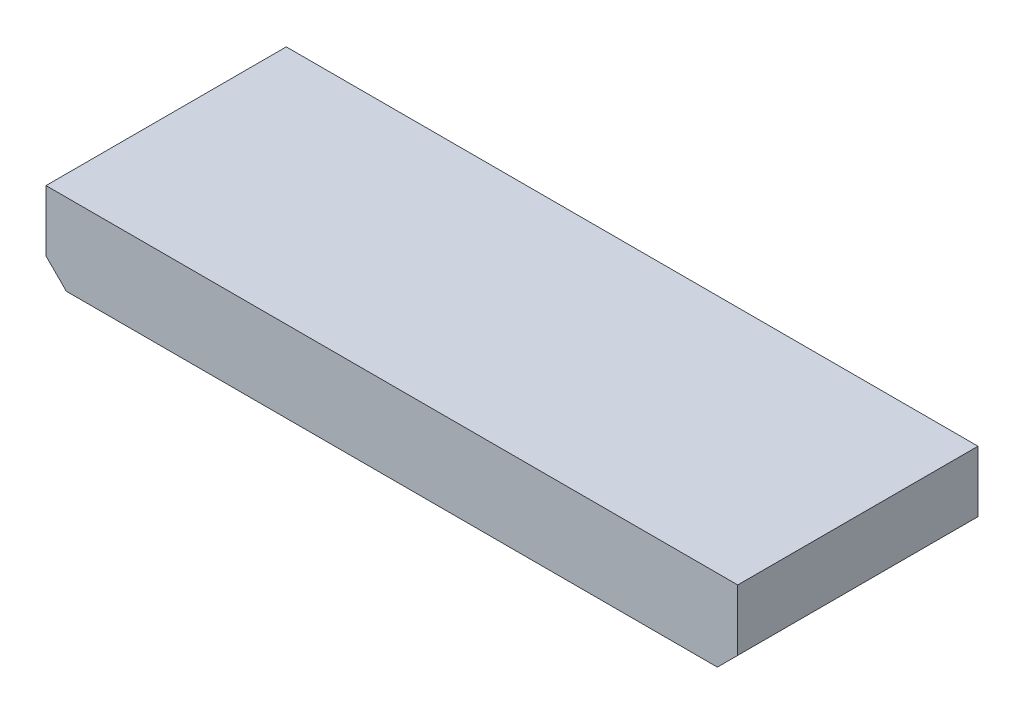
ISO-10303-21;
HEADER;
FILE_DESCRIPTION(('STEP AP214'),'2;1');
FILE_NAME('part.step','',(''),(''),'','','');
FILE_SCHEMA(('AUTOMOTIVE_DESIGN { 1 0 10303 214 1 1 1 1 }'));
ENDSEC;
DATA;
#1=APPLICATION_CONTEXT('core data for automotive mechanical design processes');
#2=APPLICATION_PROTOCOL_DEFINITION('international standard','automotive_design',2000,#1);
#3=PRODUCT_CONTEXT('',#1,'mechanical');
#4=PRODUCT('Part','Part','',(#3));
#5=PRODUCT_RELATED_PRODUCT_CATEGORY('part','',(#4));
#6=PRODUCT_DEFINITION_FORMATION('','',#4);
#7=PRODUCT_DEFINITION_CONTEXT('part definition',#1,'design');
#8=PRODUCT_DEFINITION('design','',#6,#7);
#9=PRODUCT_DEFINITION_SHAPE('','',#8);
#10=(LENGTH_UNIT() NAMED_UNIT(*) SI_UNIT(.MILLI.,.METRE.));
#11=(NAMED_UNIT(*) PLANE_ANGLE_UNIT() SI_UNIT($,.RADIAN.));
#12=(NAMED_UNIT(*) SI_UNIT($,.STERADIAN.) SOLID_ANGLE_UNIT());
#13=UNCERTAINTY_MEASURE_WITH_UNIT(LENGTH_MEASURE(1.E-05),#10,'distance_accuracy_value','');
#14=(GEOMETRIC_REPRESENTATION_CONTEXT(3) GLOBAL_UNCERTAINTY_ASSIGNED_CONTEXT((#13)) GLOBAL_UNIT_ASSIGNED_CONTEXT((#10,
#11,#12)) REPRESENTATION_CONTEXT('',''));
#15=CARTESIAN_POINT('',(0.,0.,0.));
#16=DIRECTION('',(0.,0.,1.));
#17=DIRECTION('',(1.,0.,0.));
#18=AXIS2_PLACEMENT_3D('',#15,#16,#17);
#19=CARTESIAN_POINT('',(33.02,0.,-2.));
#20=DIRECTION('',(0.,0.,1.));
#21=DIRECTION('',(1.,0.,0.));
#22=AXIS2_PLACEMENT_3D('',#19,#20,#21);
#23=CYLINDRICAL_SURFACE('',#22,0.25);
#24=CARTESIAN_POINT('',(33.02,0.,-2.));
#25=DIRECTION('',(0.,0.,1.));
#26=DIRECTION('',(1.,0.,0.));
#27=AXIS2_PLACEMENT_3D('',#24,#25,#26);
#28=CIRCLE('',#27,0.25);
#29=CARTESIAN_POINT('',(33.27,0.,-2.));
#30=VERTEX_POINT('',#29);
#31=EDGE_CURVE('E11',#30,#30,#28,.T.);
#32=ORIENTED_EDGE('',*,*,#31,.T.);
#33=EDGE_LOOP('',(#32));
#34=FACE_BOUND('',#33,.T.);
#35=CARTESIAN_POINT('',(33.02,0.,0.));
#36=DIRECTION('',(0.,0.,1.));
#37=DIRECTION('',(1.,0.,0.));
#38=AXIS2_PLACEMENT_3D('',#35,#36,#37);
#39=CIRCLE('',#38,0.25);
#40=CARTESIAN_POINT('',(33.27,0.,0.));
#41=VERTEX_POINT('',#40);
#42=EDGE_CURVE('E43',#41,#41,#39,.T.);
#43=ORIENTED_EDGE('',*,*,#42,.F.);
#44=EDGE_LOOP('',(#43));
#45=FACE_BOUND('',#44,.T.);
#46=ADVANCED_FACE('F40',(#34,#45),#23,.T.);
#47=CARTESIAN_POINT('',(33.02,0.,-2.));
#48=DIRECTION('',(0.,0.,1.));
#49=DIRECTION('',(1.,0.,0.));
#50=AXIS2_PLACEMENT_3D('',#47,#48,#49);
#51=PLANE('',#50);
#52=ORIENTED_EDGE('',*,*,#31,.F.);
#53=EDGE_LOOP('',(#52));
#54=FACE_BOUND('',#53,.T.);
#55=ADVANCED_FACE('F55',(#54),#51,.F.);
#56=CARTESIAN_POINT('',(33.02,0.,0.));
#57=DIRECTION('',(0.,0.,1.));
#58=DIRECTION('',(1.,0.,0.));
#59=AXIS2_PLACEMENT_3D('',#56,#57,#58);
#60=PLANE('',#59);
#61=ORIENTED_EDGE('',*,*,#42,.T.);
#62=EDGE_LOOP('',(#61));
#63=FACE_BOUND('',#62,.T.);
#64=ADVANCED_FACE('F52',(#63),#60,.T.);
#65=CLOSED_SHELL('',(#46,#55,#64));
#66=MANIFOLD_SOLID_BREP('B2',#65);
#67=CARTESIAN_POINT('',(30.48,0.,-2.));
#68=DIRECTION('',(0.,0.,1.));
#69=DIRECTION('',(1.,0.,0.));
#70=AXIS2_PLACEMENT_3D('',#67,#68,#69);
#71=CYLINDRICAL_SURFACE('',#70,0.25);
#72=CARTESIAN_POINT('',(30.48,0.,-2.));
#73=DIRECTION('',(0.,0.,1.));
#74=DIRECTION('',(1.,0.,0.));
#75=AXIS2_PLACEMENT_3D('',#72,#73,#74);
#76=CIRCLE('',#75,0.25);
#77=CARTESIAN_POINT('',(30.73,0.,-2.));
#78=VERTEX_POINT('',#77);
#79=EDGE_CURVE('E39',#78,#78,#76,.T.);
#80=ORIENTED_EDGE('',*,*,#79,.T.);
#81=EDGE_LOOP('',(#80));
#82=FACE_BOUND('',#81,.T.);
#83=CARTESIAN_POINT('',(30.48,0.,0.));
#84=DIRECTION('',(0.,0.,1.));
#85=DIRECTION('',(1.,0.,0.));
#86=AXIS2_PLACEMENT_3D('',#83,#84,#85);
#87=CIRCLE('',#86,0.25);
#88=CARTESIAN_POINT('',(30.73,0.,0.));
#89=VERTEX_POINT('',#88);
#90=EDGE_CURVE('E92',#89,#89,#87,.T.);
#91=ORIENTED_EDGE('',*,*,#90,.F.);
#92=EDGE_LOOP('',(#91));
#93=FACE_BOUND('',#92,.T.);
#94=ADVANCED_FACE('F89',(#82,#93),#71,.T.);
#95=CARTESIAN_POINT('',(30.48,0.,-2.));
#96=DIRECTION('',(0.,0.,1.));
#97=DIRECTION('',(1.,0.,0.));
#98=AXIS2_PLACEMENT_3D('',#95,#96,#97);
#99=PLANE('',#98);
#100=ORIENTED_EDGE('',*,*,#79,.F.);
#101=EDGE_LOOP('',(#100));
#102=FACE_BOUND('',#101,.T.);
#103=ADVANCED_FACE('F104',(#102),#99,.F.);
#104=CARTESIAN_POINT('',(30.48,0.,0.));
#105=DIRECTION('',(0.,0.,1.));
#106=DIRECTION('',(1.,0.,0.));
#107=AXIS2_PLACEMENT_3D('',#104,#105,#106);
#108=PLANE('',#107);
#109=ORIENTED_EDGE('',*,*,#90,.T.);
#110=EDGE_LOOP('',(#109));
#111=FACE_BOUND('',#110,.T.);
#112=ADVANCED_FACE('F101',(#111),#108,.T.);
#113=CLOSED_SHELL('',(#94,#103,#112));
#114=MANIFOLD_SOLID_BREP('B6',#113);
#115=CARTESIAN_POINT('',(27.94,0.,-2.));
#116=DIRECTION('',(0.,0.,1.));
#117=DIRECTION('',(1.,0.,0.));
#118=AXIS2_PLACEMENT_3D('',#115,#116,#117);
#119=CYLINDRICAL_SURFACE('',#118,0.25);
#120=CARTESIAN_POINT('',(27.94,0.,-2.));
#121=DIRECTION('',(0.,0.,1.));
#122=DIRECTION('',(1.,0.,0.));
#123=AXIS2_PLACEMENT_3D('',#120,#121,#122);
#124=CIRCLE('',#123,0.25);
#125=CARTESIAN_POINT('',(28.19,0.,-2.));
#126=VERTEX_POINT('',#125);
#127=EDGE_CURVE('E88',#126,#126,#124,.T.);
#128=ORIENTED_EDGE('',*,*,#127,.T.);
#129=EDGE_LOOP('',(#128));
#130=FACE_BOUND('',#129,.T.);
#131=CARTESIAN_POINT('',(27.94,0.,0.));
#132=DIRECTION('',(0.,0.,1.));
#133=DIRECTION('',(1.,0.,0.));
#134=AXIS2_PLACEMENT_3D('',#131,#132,#133);
#135=CIRCLE('',#134,0.25);
#136=CARTESIAN_POINT('',(28.19,0.,0.));
#137=VERTEX_POINT('',#136);
#138=EDGE_CURVE('E141',#137,#137,#135,.T.);
#139=ORIENTED_EDGE('',*,*,#138,.F.);
#140=EDGE_LOOP('',(#139));
#141=FACE_BOUND('',#140,.T.);
#142=ADVANCED_FACE('F138',(#130,#141),#119,.T.);
#143=CARTESIAN_POINT('',(27.94,0.,-2.));
#144=DIRECTION('',(0.,0.,1.));
#145=DIRECTION('',(1.,0.,0.));
#146=AXIS2_PLACEMENT_3D('',#143,#144,#145);
#147=PLANE('',#146);
#148=ORIENTED_EDGE('',*,*,#127,.F.);
#149=EDGE_LOOP('',(#148));
#150=FACE_BOUND('',#149,.T.);
#151=ADVANCED_FACE('F153',(#150),#147,.F.);
#152=CARTESIAN_POINT('',(27.94,0.,0.));
#153=DIRECTION('',(0.,0.,1.));
#154=DIRECTION('',(1.,0.,0.));
#155=AXIS2_PLACEMENT_3D('',#152,#153,#154);
#156=PLANE('',#155);
#157=ORIENTED_EDGE('',*,*,#138,.T.);
#158=EDGE_LOOP('',(#157));
#159=FACE_BOUND('',#158,.T.);
#160=ADVANCED_FACE('F150',(#159),#156,.T.);
#161=CLOSED_SHELL('',(#142,#151,#160));
#162=MANIFOLD_SOLID_BREP('B34',#161);
#163=CARTESIAN_POINT('',(25.4,0.,-2.));
#164=DIRECTION('',(0.,0.,1.));
#165=DIRECTION('',(1.,0.,0.));
#166=AXIS2_PLACEMENT_3D('',#163,#164,#165);
#167=CYLINDRICAL_SURFACE('',#166,0.25);
#168=CARTESIAN_POINT('',(25.4,0.,-2.));
#169=DIRECTION('',(0.,0.,1.));
#170=DIRECTION('',(1.,0.,0.));
#171=AXIS2_PLACEMENT_3D('',#168,#169,#170);
#172=CIRCLE('',#171,0.25);
#173=CARTESIAN_POINT('',(25.65,0.,-2.));
#174=VERTEX_POINT('',#173);
#175=EDGE_CURVE('E137',#174,#174,#172,.T.);
#176=ORIENTED_EDGE('',*,*,#175,.T.);
#177=EDGE_LOOP('',(#176));
#178=FACE_BOUND('',#177,.T.);
#179=CARTESIAN_POINT('',(25.4,0.,0.));
#180=DIRECTION('',(0.,0.,1.));
#181=DIRECTION('',(1.,0.,0.));
#182=AXIS2_PLACEMENT_3D('',#179,#180,#181);
#183=CIRCLE('',#182,0.25);
#184=CARTESIAN_POINT('',(25.65,0.,0.));
#185=VERTEX_POINT('',#184);
#186=EDGE_CURVE('E190',#185,#185,#183,.T.);
#187=ORIENTED_EDGE('',*,*,#186,.F.);
#188=EDGE_LOOP('',(#187));
#189=FACE_BOUND('',#188,.T.);
#190=ADVANCED_FACE('F187',(#178,#189),#167,.T.);
#191=CARTESIAN_POINT('',(25.4,0.,-2.));
#192=DIRECTION('',(0.,0.,1.));
#193=DIRECTION('',(1.,0.,0.));
#194=AXIS2_PLACEMENT_3D('',#191,#192,#193);
#195=PLANE('',#194);
#196=ORIENTED_EDGE('',*,*,#175,.F.);
#197=EDGE_LOOP('',(#196));
#198=FACE_BOUND('',#197,.T.);
#199=ADVANCED_FACE('F202',(#198),#195,.F.);
#200=CARTESIAN_POINT('',(25.4,0.,0.));
#201=DIRECTION('',(0.,0.,1.));
#202=DIRECTION('',(1.,0.,0.));
#203=AXIS2_PLACEMENT_3D('',#200,#201,#202);
#204=PLANE('',#203);
#205=ORIENTED_EDGE('',*,*,#186,.T.);
#206=EDGE_LOOP('',(#205));
#207=FACE_BOUND('',#206,.T.);
#208=ADVANCED_FACE('F199',(#207),#204,.T.);
#209=CLOSED_SHELL('',(#190,#199,#208));
#210=MANIFOLD_SOLID_BREP('B83',#209);
#211=CARTESIAN_POINT('',(22.86,0.,-2.));
#212=DIRECTION('',(0.,0.,1.));
#213=DIRECTION('',(1.,0.,0.));
#214=AXIS2_PLACEMENT_3D('',#211,#212,#213);
#215=CYLINDRICAL_SURFACE('',#214,0.25);
#216=CARTESIAN_POINT('',(22.86,0.,-2.));
#217=DIRECTION('',(0.,0.,1.));
#218=DIRECTION('',(1.,0.,0.));
#219=AXIS2_PLACEMENT_3D('',#216,#217,#218);
#220=CIRCLE('',#219,0.25);
#221=CARTESIAN_POINT('',(23.11,0.,-2.));
#222=VERTEX_POINT('',#221);
#223=EDGE_CURVE('E186',#222,#222,#220,.T.);
#224=ORIENTED_EDGE('',*,*,#223,.T.);
#225=EDGE_LOOP('',(#224));
#226=FACE_BOUND('',#225,.T.);
#227=CARTESIAN_POINT('',(22.86,0.,0.));
#228=DIRECTION('',(0.,0.,1.));
#229=DIRECTION('',(1.,0.,0.));
#230=AXIS2_PLACEMENT_3D('',#227,#228,#229);
#231=CIRCLE('',#230,0.25);
#232=CARTESIAN_POINT('',(23.11,0.,0.));
#233=VERTEX_POINT('',#232);
#234=EDGE_CURVE('E239',#233,#233,#231,.T.);
#235=ORIENTED_EDGE('',*,*,#234,.F.);
#236=EDGE_LOOP('',(#235));
#237=FACE_BOUND('',#236,.T.);
#238=ADVANCED_FACE('F236',(#226,#237),#215,.T.);
#239=CARTESIAN_POINT('',(22.86,0.,-2.));
#240=DIRECTION('',(0.,0.,1.));
#241=DIRECTION('',(1.,0.,0.));
#242=AXIS2_PLACEMENT_3D('',#239,#240,#241);
#243=PLANE('',#242);
#244=ORIENTED_EDGE('',*,*,#223,.F.);
#245=EDGE_LOOP('',(#244));
#246=FACE_BOUND('',#245,.T.);
#247=ADVANCED_FACE('F251',(#246),#243,.F.);
#248=CARTESIAN_POINT('',(22.86,0.,0.));
#249=DIRECTION('',(0.,0.,1.));
#250=DIRECTION('',(1.,0.,0.));
#251=AXIS2_PLACEMENT_3D('',#248,#249,#250);
#252=PLANE('',#251);
#253=ORIENTED_EDGE('',*,*,#234,.T.);
#254=EDGE_LOOP('',(#253));
#255=FACE_BOUND('',#254,.T.);
#256=ADVANCED_FACE('F248',(#255),#252,.T.);
#257=CLOSED_SHELL('',(#238,#247,#256));
#258=MANIFOLD_SOLID_BREP('B132',#257);
#259=CARTESIAN_POINT('',(20.32,0.,-2.));
#260=DIRECTION('',(0.,0.,1.));
#261=DIRECTION('',(1.,0.,0.));
#262=AXIS2_PLACEMENT_3D('',#259,#260,#261);
#263=CYLINDRICAL_SURFACE('',#262,0.25);
#264=CARTESIAN_POINT('',(20.32,0.,-2.));
#265=DIRECTION('',(0.,0.,1.));
#266=DIRECTION('',(1.,0.,0.));
#267=AXIS2_PLACEMENT_3D('',#264,#265,#266);
#268=CIRCLE('',#267,0.25);
#269=CARTESIAN_POINT('',(20.57,0.,-2.));
#270=VERTEX_POINT('',#269);
#271=EDGE_CURVE('E235',#270,#270,#268,.T.);
#272=ORIENTED_EDGE('',*,*,#271,.T.);
#273=EDGE_LOOP('',(#272));
#274=FACE_BOUND('',#273,.T.);
#275=CARTESIAN_POINT('',(20.32,0.,0.));
#276=DIRECTION('',(0.,0.,1.));
#277=DIRECTION('',(1.,0.,0.));
#278=AXIS2_PLACEMENT_3D('',#275,#276,#277);
#279=CIRCLE('',#278,0.25);
#280=CARTESIAN_POINT('',(20.57,0.,0.));
#281=VERTEX_POINT('',#280);
#282=EDGE_CURVE('E288',#281,#281,#279,.T.);
#283=ORIENTED_EDGE('',*,*,#282,.F.);
#284=EDGE_LOOP('',(#283));
#285=FACE_BOUND('',#284,.T.);
#286=ADVANCED_FACE('F285',(#274,#285),#263,.T.);
#287=CARTESIAN_POINT('',(20.32,0.,-2.));
#288=DIRECTION('',(0.,0.,1.));
#289=DIRECTION('',(1.,0.,0.));
#290=AXIS2_PLACEMENT_3D('',#287,#288,#289);
#291=PLANE('',#290);
#292=ORIENTED_EDGE('',*,*,#271,.F.);
#293=EDGE_LOOP('',(#292));
#294=FACE_BOUND('',#293,.T.);
#295=ADVANCED_FACE('F300',(#294),#291,.F.);
#296=CARTESIAN_POINT('',(20.32,0.,0.));
#297=DIRECTION('',(0.,0.,1.));
#298=DIRECTION('',(1.,0.,0.));
#299=AXIS2_PLACEMENT_3D('',#296,#297,#298);
#300=PLANE('',#299);
#301=ORIENTED_EDGE('',*,*,#282,.T.);
#302=EDGE_LOOP('',(#301));
#303=FACE_BOUND('',#302,.T.);
#304=ADVANCED_FACE('F297',(#303),#300,.T.);
#305=CLOSED_SHELL('',(#286,#295,#304));
#306=MANIFOLD_SOLID_BREP('B181',#305);
#307=CARTESIAN_POINT('',(17.78,0.,-2.));
#308=DIRECTION('',(0.,0.,1.));
#309=DIRECTION('',(1.,0.,0.));
#310=AXIS2_PLACEMENT_3D('',#307,#308,#309);
#311=CYLINDRICAL_SURFACE('',#310,0.25);
#312=CARTESIAN_POINT('',(17.78,0.,-2.));
#313=DIRECTION('',(0.,0.,1.));
#314=DIRECTION('',(1.,0.,0.));
#315=AXIS2_PLACEMENT_3D('',#312,#313,#314);
#316=CIRCLE('',#315,0.25);
#317=CARTESIAN_POINT('',(18.03,0.,-2.));
#318=VERTEX_POINT('',#317);
#319=EDGE_CURVE('E284',#318,#318,#316,.T.);
#320=ORIENTED_EDGE('',*,*,#319,.T.);
#321=EDGE_LOOP('',(#320));
#322=FACE_BOUND('',#321,.T.);
#323=CARTESIAN_POINT('',(17.78,0.,0.));
#324=DIRECTION('',(0.,0.,1.));
#325=DIRECTION('',(1.,0.,0.));
#326=AXIS2_PLACEMENT_3D('',#323,#324,#325);
#327=CIRCLE('',#326,0.25);
#328=CARTESIAN_POINT('',(18.03,0.,0.));
#329=VERTEX_POINT('',#328);
#330=EDGE_CURVE('E337',#329,#329,#327,.T.);
#331=ORIENTED_EDGE('',*,*,#330,.F.);
#332=EDGE_LOOP('',(#331));
#333=FACE_BOUND('',#332,.T.);
#334=ADVANCED_FACE('F334',(#322,#333),#311,.T.);
#335=CARTESIAN_POINT('',(17.78,0.,-2.));
#336=DIRECTION('',(0.,0.,1.));
#337=DIRECTION('',(1.,0.,0.));
#338=AXIS2_PLACEMENT_3D('',#335,#336,#337);
#339=PLANE('',#338);
#340=ORIENTED_EDGE('',*,*,#319,.F.);
#341=EDGE_LOOP('',(#340));
#342=FACE_BOUND('',#341,.T.);
#343=ADVANCED_FACE('F349',(#342),#339,.F.);
#344=CARTESIAN_POINT('',(17.78,0.,0.));
#345=DIRECTION('',(0.,0.,1.));
#346=DIRECTION('',(1.,0.,0.));
#347=AXIS2_PLACEMENT_3D('',#344,#345,#346);
#348=PLANE('',#347);
#349=ORIENTED_EDGE('',*,*,#330,.T.);
#350=EDGE_LOOP('',(#349));
#351=FACE_BOUND('',#350,.T.);
#352=ADVANCED_FACE('F346',(#351),#348,.T.);
#353=CLOSED_SHELL('',(#334,#343,#352));
#354=MANIFOLD_SOLID_BREP('B230',#353);
#355=CARTESIAN_POINT('',(15.24,0.,-2.));
#356=DIRECTION('',(0.,0.,1.));
#357=DIRECTION('',(1.,0.,0.));
#358=AXIS2_PLACEMENT_3D('',#355,#356,#357);
#359=CYLINDRICAL_SURFACE('',#358,0.25);
#360=CARTESIAN_POINT('',(15.24,0.,-2.));
#361=DIRECTION('',(0.,0.,1.));
#362=DIRECTION('',(1.,0.,0.));
#363=AXIS2_PLACEMENT_3D('',#360,#361,#362);
#364=CIRCLE('',#363,0.25);
#365=CARTESIAN_POINT('',(15.49,0.,-2.));
#366=VERTEX_POINT('',#365);
#367=EDGE_CURVE('E333',#366,#366,#364,.T.);
#368=ORIENTED_EDGE('',*,*,#367,.T.);
#369=EDGE_LOOP('',(#368));
#370=FACE_BOUND('',#369,.T.);
#371=CARTESIAN_POINT('',(15.24,0.,0.));
#372=DIRECTION('',(0.,0.,1.));
#373=DIRECTION('',(1.,0.,0.));
#374=AXIS2_PLACEMENT_3D('',#371,#372,#373);
#375=CIRCLE('',#374,0.25);
#376=CARTESIAN_POINT('',(15.49,0.,0.));
#377=VERTEX_POINT('',#376);
#378=EDGE_CURVE('E386',#377,#377,#375,.T.);
#379=ORIENTED_EDGE('',*,*,#378,.F.);
#380=EDGE_LOOP('',(#379));
#381=FACE_BOUND('',#380,.T.);
#382=ADVANCED_FACE('F383',(#370,#381),#359,.T.);
#383=CARTESIAN_POINT('',(15.24,0.,-2.));
#384=DIRECTION('',(0.,0.,1.));
#385=DIRECTION('',(1.,0.,0.));
#386=AXIS2_PLACEMENT_3D('',#383,#384,#385);
#387=PLANE('',#386);
#388=ORIENTED_EDGE('',*,*,#367,.F.);
#389=EDGE_LOOP('',(#388));
#390=FACE_BOUND('',#389,.T.);
#391=ADVANCED_FACE('F398',(#390),#387,.F.);
#392=CARTESIAN_POINT('',(15.24,0.,0.));
#393=DIRECTION('',(0.,0.,1.));
#394=DIRECTION('',(1.,0.,0.));
#395=AXIS2_PLACEMENT_3D('',#392,#393,#394);
#396=PLANE('',#395);
#397=ORIENTED_EDGE('',*,*,#378,.T.);
#398=EDGE_LOOP('',(#397));
#399=FACE_BOUND('',#398,.T.);
#400=ADVANCED_FACE('F395',(#399),#396,.T.);
#401=CLOSED_SHELL('',(#382,#391,#400));
#402=MANIFOLD_SOLID_BREP('B279',#401);
#403=CARTESIAN_POINT('',(12.7,0.,-2.));
#404=DIRECTION('',(0.,0.,1.));
#405=DIRECTION('',(1.,0.,0.));
#406=AXIS2_PLACEMENT_3D('',#403,#404,#405);
#407=CYLINDRICAL_SURFACE('',#406,0.25);
#408=CARTESIAN_POINT('',(12.7,0.,-2.));
#409=DIRECTION('',(0.,0.,1.));
#410=DIRECTION('',(1.,0.,0.));
#411=AXIS2_PLACEMENT_3D('',#408,#409,#410);
#412=CIRCLE('',#411,0.25);
#413=CARTESIAN_POINT('',(12.95,0.,-2.));
#414=VERTEX_POINT('',#413);
#415=EDGE_CURVE('E382',#414,#414,#412,.T.);
#416=ORIENTED_EDGE('',*,*,#415,.T.);
#417=EDGE_LOOP('',(#416));
#418=FACE_BOUND('',#417,.T.);
#419=CARTESIAN_POINT('',(12.7,0.,0.));
#420=DIRECTION('',(0.,0.,1.));
#421=DIRECTION('',(1.,0.,0.));
#422=AXIS2_PLACEMENT_3D('',#419,#420,#421);
#423=CIRCLE('',#422,0.25);
#424=CARTESIAN_POINT('',(12.95,0.,0.));
#425=VERTEX_POINT('',#424);
#426=EDGE_CURVE('E435',#425,#425,#423,.T.);
#427=ORIENTED_EDGE('',*,*,#426,.F.);
#428=EDGE_LOOP('',(#427));
#429=FACE_BOUND('',#428,.T.);
#430=ADVANCED_FACE('F432',(#418,#429),#407,.T.);
#431=CARTESIAN_POINT('',(12.7,0.,-2.));
#432=DIRECTION('',(0.,0.,1.));
#433=DIRECTION('',(1.,0.,0.));
#434=AXIS2_PLACEMENT_3D('',#431,#432,#433);
#435=PLANE('',#434);
#436=ORIENTED_EDGE('',*,*,#415,.F.);
#437=EDGE_LOOP('',(#436));
#438=FACE_BOUND('',#437,.T.);
#439=ADVANCED_FACE('F447',(#438),#435,.F.);
#440=CARTESIAN_POINT('',(12.7,0.,0.));
#441=DIRECTION('',(0.,0.,1.));
#442=DIRECTION('',(1.,0.,0.));
#443=AXIS2_PLACEMENT_3D('',#440,#441,#442);
#444=PLANE('',#443);
#445=ORIENTED_EDGE('',*,*,#426,.T.);
#446=EDGE_LOOP('',(#445));
#447=FACE_BOUND('',#446,.T.);
#448=ADVANCED_FACE('F444',(#447),#444,.T.);
#449=CLOSED_SHELL('',(#430,#439,#448));
#450=MANIFOLD_SOLID_BREP('B328',#449);
#451=CARTESIAN_POINT('',(10.16,0.,-2.));
#452=DIRECTION('',(0.,0.,1.));
#453=DIRECTION('',(1.,0.,0.));
#454=AXIS2_PLACEMENT_3D('',#451,#452,#453);
#455=CYLINDRICAL_SURFACE('',#454,0.25);
#456=CARTESIAN_POINT('',(10.16,0.,-2.));
#457=DIRECTION('',(0.,0.,1.));
#458=DIRECTION('',(1.,0.,0.));
#459=AXIS2_PLACEMENT_3D('',#456,#457,#458);
#460=CIRCLE('',#459,0.25);
#461=CARTESIAN_POINT('',(10.41,0.,-2.));
#462=VERTEX_POINT('',#461);
#463=EDGE_CURVE('E431',#462,#462,#460,.T.);
#464=ORIENTED_EDGE('',*,*,#463,.T.);
#465=EDGE_LOOP('',(#464));
#466=FACE_BOUND('',#465,.T.);
#467=CARTESIAN_POINT('',(10.16,0.,0.));
#468=DIRECTION('',(0.,0.,1.));
#469=DIRECTION('',(1.,0.,0.));
#470=AXIS2_PLACEMENT_3D('',#467,#468,#469);
#471=CIRCLE('',#470,0.25);
#472=CARTESIAN_POINT('',(10.41,0.,0.));
#473=VERTEX_POINT('',#472);
#474=EDGE_CURVE('E484',#473,#473,#471,.T.);
#475=ORIENTED_EDGE('',*,*,#474,.F.);
#476=EDGE_LOOP('',(#475));
#477=FACE_BOUND('',#476,.T.);
#478=ADVANCED_FACE('F481',(#466,#477),#455,.T.);
#479=CARTESIAN_POINT('',(10.16,0.,-2.));
#480=DIRECTION('',(0.,0.,1.));
#481=DIRECTION('',(1.,0.,0.));
#482=AXIS2_PLACEMENT_3D('',#479,#480,#481);
#483=PLANE('',#482);
#484=ORIENTED_EDGE('',*,*,#463,.F.);
#485=EDGE_LOOP('',(#484));
#486=FACE_BOUND('',#485,.T.);
#487=ADVANCED_FACE('F496',(#486),#483,.F.);
#488=CARTESIAN_POINT('',(10.16,0.,0.));
#489=DIRECTION('',(0.,0.,1.));
#490=DIRECTION('',(1.,0.,0.));
#491=AXIS2_PLACEMENT_3D('',#488,#489,#490);
#492=PLANE('',#491);
#493=ORIENTED_EDGE('',*,*,#474,.T.);
#494=EDGE_LOOP('',(#493));
#495=FACE_BOUND('',#494,.T.);
#496=ADVANCED_FACE('F493',(#495),#492,.T.);
#497=CLOSED_SHELL('',(#478,#487,#496));
#498=MANIFOLD_SOLID_BREP('B377',#497);
#499=CARTESIAN_POINT('',(7.62,0.,-2.));
#500=DIRECTION('',(0.,0.,1.));
#501=DIRECTION('',(1.,0.,0.));
#502=AXIS2_PLACEMENT_3D('',#499,#500,#501);
#503=CYLINDRICAL_SURFACE('',#502,0.25);
#504=CARTESIAN_POINT('',(7.62,0.,-2.));
#505=DIRECTION('',(0.,0.,1.));
#506=DIRECTION('',(1.,0.,0.));
#507=AXIS2_PLACEMENT_3D('',#504,#505,#506);
#508=CIRCLE('',#507,0.25);
#509=CARTESIAN_POINT('',(7.87,0.,-2.));
#510=VERTEX_POINT('',#509);
#511=EDGE_CURVE('E480',#510,#510,#508,.T.);
#512=ORIENTED_EDGE('',*,*,#511,.T.);
#513=EDGE_LOOP('',(#512));
#514=FACE_BOUND('',#513,.T.);
#515=CARTESIAN_POINT('',(7.62,0.,0.));
#516=DIRECTION('',(0.,0.,1.));
#517=DIRECTION('',(1.,0.,0.));
#518=AXIS2_PLACEMENT_3D('',#515,#516,#517);
#519=CIRCLE('',#518,0.25);
#520=CARTESIAN_POINT('',(7.87,0.,0.));
#521=VERTEX_POINT('',#520);
#522=EDGE_CURVE('E533',#521,#521,#519,.T.);
#523=ORIENTED_EDGE('',*,*,#522,.F.);
#524=EDGE_LOOP('',(#523));
#525=FACE_BOUND('',#524,.T.);
#526=ADVANCED_FACE('F530',(#514,#525),#503,.T.);
#527=CARTESIAN_POINT('',(7.62,0.,-2.));
#528=DIRECTION('',(0.,0.,1.));
#529=DIRECTION('',(1.,0.,0.));
#530=AXIS2_PLACEMENT_3D('',#527,#528,#529);
#531=PLANE('',#530);
#532=ORIENTED_EDGE('',*,*,#511,.F.);
#533=EDGE_LOOP('',(#532));
#534=FACE_BOUND('',#533,.T.);
#535=ADVANCED_FACE('F545',(#534),#531,.F.);
#536=CARTESIAN_POINT('',(7.62,0.,0.));
#537=DIRECTION('',(0.,0.,1.));
#538=DIRECTION('',(1.,0.,0.));
#539=AXIS2_PLACEMENT_3D('',#536,#537,#538);
#540=PLANE('',#539);
#541=ORIENTED_EDGE('',*,*,#522,.T.);
#542=EDGE_LOOP('',(#541));
#543=FACE_BOUND('',#542,.T.);
#544=ADVANCED_FACE('F542',(#543),#540,.T.);
#545=CLOSED_SHELL('',(#526,#535,#544));
#546=MANIFOLD_SOLID_BREP('B426',#545);
#547=CARTESIAN_POINT('',(5.08,0.,-2.));
#548=DIRECTION('',(0.,0.,1.));
#549=DIRECTION('',(1.,0.,0.));
#550=AXIS2_PLACEMENT_3D('',#547,#548,#549);
#551=CYLINDRICAL_SURFACE('',#550,0.25);
#552=CARTESIAN_POINT('',(5.08,0.,-2.));
#553=DIRECTION('',(0.,0.,1.));
#554=DIRECTION('',(1.,0.,0.));
#555=AXIS2_PLACEMENT_3D('',#552,#553,#554);
#556=CIRCLE('',#555,0.25);
#557=CARTESIAN_POINT('',(5.33,0.,-2.));
#558=VERTEX_POINT('',#557);
#559=EDGE_CURVE('E529',#558,#558,#556,.T.);
#560=ORIENTED_EDGE('',*,*,#559,.T.);
#561=EDGE_LOOP('',(#560));
#562=FACE_BOUND('',#561,.T.);
#563=CARTESIAN_POINT('',(5.08,0.,0.));
#564=DIRECTION('',(0.,0.,1.));
#565=DIRECTION('',(1.,0.,0.));
#566=AXIS2_PLACEMENT_3D('',#563,#564,#565);
#567=CIRCLE('',#566,0.25);
#568=CARTESIAN_POINT('',(5.33,0.,0.));
#569=VERTEX_POINT('',#568);
#570=EDGE_CURVE('E582',#569,#569,#567,.T.);
#571=ORIENTED_EDGE('',*,*,#570,.F.);
#572=EDGE_LOOP('',(#571));
#573=FACE_BOUND('',#572,.T.);
#574=ADVANCED_FACE('F579',(#562,#573),#551,.T.);
#575=CARTESIAN_POINT('',(5.08,0.,-2.));
#576=DIRECTION('',(0.,0.,1.));
#577=DIRECTION('',(1.,0.,0.));
#578=AXIS2_PLACEMENT_3D('',#575,#576,#577);
#579=PLANE('',#578);
#580=ORIENTED_EDGE('',*,*,#559,.F.);
#581=EDGE_LOOP('',(#580));
#582=FACE_BOUND('',#581,.T.);
#583=ADVANCED_FACE('F594',(#582),#579,.F.);
#584=CARTESIAN_POINT('',(5.08,0.,0.));
#585=DIRECTION('',(0.,0.,1.));
#586=DIRECTION('',(1.,0.,0.));
#587=AXIS2_PLACEMENT_3D('',#584,#585,#586);
#588=PLANE('',#587);
#589=ORIENTED_EDGE('',*,*,#570,.T.);
#590=EDGE_LOOP('',(#589));
#591=FACE_BOUND('',#590,.T.);
#592=ADVANCED_FACE('F591',(#591),#588,.T.);
#593=CLOSED_SHELL('',(#574,#583,#592));
#594=MANIFOLD_SOLID_BREP('B475',#593);
#595=CARTESIAN_POINT('',(2.54,0.,-2.));
#596=DIRECTION('',(0.,0.,1.));
#597=DIRECTION('',(1.,0.,0.));
#598=AXIS2_PLACEMENT_3D('',#595,#596,#597);
#599=CYLINDRICAL_SURFACE('',#598,0.25);
#600=CARTESIAN_POINT('',(2.54,0.,-2.));
#601=DIRECTION('',(0.,0.,1.));
#602=DIRECTION('',(1.,0.,0.));
#603=AXIS2_PLACEMENT_3D('',#600,#601,#602);
#604=CIRCLE('',#603,0.25);
#605=CARTESIAN_POINT('',(2.79,0.,-2.));
#606=VERTEX_POINT('',#605);
#607=EDGE_CURVE('E578',#606,#606,#604,.T.);
#608=ORIENTED_EDGE('',*,*,#607,.T.);
#609=EDGE_LOOP('',(#608));
#610=FACE_BOUND('',#609,.T.);
#611=CARTESIAN_POINT('',(2.54,0.,0.));
#612=DIRECTION('',(0.,0.,1.));
#613=DIRECTION('',(1.,0.,0.));
#614=AXIS2_PLACEMENT_3D('',#611,#612,#613);
#615=CIRCLE('',#614,0.25);
#616=CARTESIAN_POINT('',(2.79,0.,0.));
#617=VERTEX_POINT('',#616);
#618=EDGE_CURVE('E631',#617,#617,#615,.T.);
#619=ORIENTED_EDGE('',*,*,#618,.F.);
#620=EDGE_LOOP('',(#619));
#621=FACE_BOUND('',#620,.T.);
#622=ADVANCED_FACE('F628',(#610,#621),#599,.T.);
#623=CARTESIAN_POINT('',(2.54,0.,-2.));
#624=DIRECTION('',(0.,0.,1.));
#625=DIRECTION('',(1.,0.,0.));
#626=AXIS2_PLACEMENT_3D('',#623,#624,#625);
#627=PLANE('',#626);
#628=ORIENTED_EDGE('',*,*,#607,.F.);
#629=EDGE_LOOP('',(#628));
#630=FACE_BOUND('',#629,.T.);
#631=ADVANCED_FACE('F643',(#630),#627,.F.);
#632=CARTESIAN_POINT('',(2.54,0.,0.));
#633=DIRECTION('',(0.,0.,1.));
#634=DIRECTION('',(1.,0.,0.));
#635=AXIS2_PLACEMENT_3D('',#632,#633,#634);
#636=PLANE('',#635);
#637=ORIENTED_EDGE('',*,*,#618,.T.);
#638=EDGE_LOOP('',(#637));
#639=FACE_BOUND('',#638,.T.);
#640=ADVANCED_FACE('F640',(#639),#636,.T.);
#641=CLOSED_SHELL('',(#622,#631,#640));
#642=MANIFOLD_SOLID_BREP('B524',#641);
#643=CARTESIAN_POINT('',(0.,0.,-2.));
#644=DIRECTION('',(0.,0.,1.));
#645=DIRECTION('',(1.,0.,0.));
#646=AXIS2_PLACEMENT_3D('',#643,#644,#645);
#647=CYLINDRICAL_SURFACE('',#646,0.25);
#648=CARTESIAN_POINT('',(0.,0.,-2.));
#649=DIRECTION('',(0.,0.,1.));
#650=DIRECTION('',(1.,0.,0.));
#651=AXIS2_PLACEMENT_3D('',#648,#649,#650);
#652=CIRCLE('',#651,0.25);
#653=CARTESIAN_POINT('',(0.25,0.,-2.));
#654=VERTEX_POINT('',#653);
#655=EDGE_CURVE('E627',#654,#654,#652,.T.);
#656=ORIENTED_EDGE('',*,*,#655,.T.);
#657=EDGE_LOOP('',(#656));
#658=FACE_BOUND('',#657,.T.);
#659=CARTESIAN_POINT('',(0.,0.,0.));
#660=DIRECTION('',(0.,0.,1.));
#661=DIRECTION('',(1.,0.,0.));
#662=AXIS2_PLACEMENT_3D('',#659,#660,#661);
#663=CIRCLE('',#662,0.25);
#664=CARTESIAN_POINT('',(0.25,0.,0.));
#665=VERTEX_POINT('',#664);
#666=EDGE_CURVE('E681',#665,#665,#663,.T.);
#667=ORIENTED_EDGE('',*,*,#666,.F.);
#668=EDGE_LOOP('',(#667));
#669=FACE_BOUND('',#668,.T.);
#670=ADVANCED_FACE('F678',(#658,#669),#647,.T.);
#671=CARTESIAN_POINT('',(0.,0.,-2.));
#672=DIRECTION('',(0.,0.,1.));
#673=DIRECTION('',(1.,0.,0.));
#674=AXIS2_PLACEMENT_3D('',#671,#672,#673);
#675=PLANE('',#674);
#676=ORIENTED_EDGE('',*,*,#655,.F.);
#677=EDGE_LOOP('',(#676));
#678=FACE_BOUND('',#677,.T.);
#679=ADVANCED_FACE('F693',(#678),#675,.F.);
#680=CARTESIAN_POINT('',(0.,0.,0.));
#681=DIRECTION('',(0.,0.,1.));
#682=DIRECTION('',(1.,0.,0.));
#683=AXIS2_PLACEMENT_3D('',#680,#681,#682);
#684=PLANE('',#683);
#685=ORIENTED_EDGE('',*,*,#666,.T.);
#686=EDGE_LOOP('',(#685));
#687=FACE_BOUND('',#686,.T.);
#688=ADVANCED_FACE('F690',(#687),#684,.T.);
#689=CLOSED_SHELL('',(#670,#679,#688));
#690=MANIFOLD_SOLID_BREP('B573',#689);
#691=CARTESIAN_POINT('',(38.1,2.54,15.));
#692=DIRECTION('',(0.,-1.,0.));
#693=DIRECTION('',(0.,0.,-1.));
#694=AXIS2_PLACEMENT_3D('',#691,#692,#693);
#695=PLANE('',#694);
#696=DIRECTION('',(-1.,0.,0.));
#697=VECTOR('',#696,1.);
#698=CARTESIAN_POINT('',(38.1,2.54,0.));
#699=LINE('',#698,#697);
#700=CARTESIAN_POINT('',(38.1,2.54,0.));
#701=VERTEX_POINT('',#700);
#702=CARTESIAN_POINT('',(-5.08,2.54,0.));
#703=VERTEX_POINT('',#702);
#704=EDGE_CURVE('E803',#701,#703,#699,.T.);
#705=ORIENTED_EDGE('',*,*,#704,.T.);
#706=DIRECTION('',(0.,0.,-1.));
#707=VECTOR('',#706,1.);
#708=CARTESIAN_POINT('',(-5.08,2.54,15.));
#709=LINE('',#708,#707);
#710=CARTESIAN_POINT('',(-5.08,2.54,15.));
#711=VERTEX_POINT('',#710);
#712=EDGE_CURVE('E676',#711,#703,#709,.T.);
#713=ORIENTED_EDGE('',*,*,#712,.F.);
#714=DIRECTION('',(-1.,0.,0.));
#715=VECTOR('',#714,1.);
#716=CARTESIAN_POINT('',(38.1,2.54,15.));
#717=LINE('',#716,#715);
#718=CARTESIAN_POINT('',(38.1,2.54,15.));
#719=VERTEX_POINT('',#718);
#720=EDGE_CURVE('E813',#719,#711,#717,.T.);
#721=ORIENTED_EDGE('',*,*,#720,.F.);
#722=DIRECTION('',(0.,0.,-1.));
#723=VECTOR('',#722,1.);
#724=CARTESIAN_POINT('',(38.1,2.54,15.));
#725=LINE('',#724,#723);
#726=EDGE_CURVE('E799',#719,#701,#725,.T.);
#727=ORIENTED_EDGE('',*,*,#726,.T.);
#728=EDGE_LOOP('',(#705,#713,#721,#727));
#729=FACE_BOUND('',#728,.T.);
#730=ADVANCED_FACE('F719',(#729),#695,.F.);
#731=CARTESIAN_POINT('',(-5.08,2.54,15.));
#732=DIRECTION('',(1.,0.,0.));
#733=DIRECTION('',(0.,0.,-1.));
#734=AXIS2_PLACEMENT_3D('',#731,#732,#733);
#735=PLANE('',#734);
#736=DIRECTION('',(0.,-1.,0.));
#737=VECTOR('',#736,1.);
#738=CARTESIAN_POINT('',(-5.08,2.54,0.));
#739=LINE('',#738,#737);
#740=CARTESIAN_POINT('',(-5.08,-1.27,0.));
#741=VERTEX_POINT('',#740);
#742=EDGE_CURVE('E806',#703,#741,#739,.T.);
#743=ORIENTED_EDGE('',*,*,#742,.T.);
#744=DIRECTION('',(0.,0.,-1.));
#745=VECTOR('',#744,1.);
#746=CARTESIAN_POINT('',(-5.08,-1.27,15.));
#747=LINE('',#746,#745);
#748=CARTESIAN_POINT('',(-5.08,-1.27,15.));
#749=VERTEX_POINT('',#748);
#750=EDGE_CURVE('E727',#749,#741,#747,.T.);
#751=ORIENTED_EDGE('',*,*,#750,.F.);
#752=DIRECTION('',(0.,-1.,0.));
#753=VECTOR('',#752,1.);
#754=CARTESIAN_POINT('',(-5.08,2.54,15.));
#755=LINE('',#754,#753);
#756=EDGE_CURVE('E772',#711,#749,#755,.T.);
#757=ORIENTED_EDGE('',*,*,#756,.F.);
#758=ORIENTED_EDGE('',*,*,#712,.T.);
#759=EDGE_LOOP('',(#743,#751,#757,#758));
#760=FACE_BOUND('',#759,.T.);
#761=ADVANCED_FACE('F837',(#760),#735,.F.);
#762=CARTESIAN_POINT('',(-5.08,-1.27,15.));
#763=DIRECTION('',(0.707106781186547,0.707106781186548,0.));
#764=DIRECTION('',(-0.707106781186548,0.707106781186547,0.));
#765=AXIS2_PLACEMENT_3D('',#762,#763,#764);
#766=PLANE('',#765);
#767=DIRECTION('',(0.707106781186548,-0.707106781186547,0.));
#768=VECTOR('',#767,1.);
#769=CARTESIAN_POINT('',(-5.08,-1.27,0.));
#770=LINE('',#769,#768);
#771=CARTESIAN_POINT('',(-3.81,-2.54,0.));
#772=VERTEX_POINT('',#771);
#773=EDGE_CURVE('E808',#741,#772,#770,.T.);
#774=ORIENTED_EDGE('',*,*,#773,.T.);
#775=DIRECTION('',(0.,0.,-1.));
#776=VECTOR('',#775,1.);
#777=CARTESIAN_POINT('',(-3.81,-2.54,15.));
#778=LINE('',#777,#776);
#779=CARTESIAN_POINT('',(-3.81,-2.54,15.));
#780=VERTEX_POINT('',#779);
#781=EDGE_CURVE('E794',#780,#772,#778,.T.);
#782=ORIENTED_EDGE('',*,*,#781,.F.);
#783=DIRECTION('',(0.707106781186548,-0.707106781186547,0.));
#784=VECTOR('',#783,1.);
#785=CARTESIAN_POINT('',(-5.08,-1.27,15.));
#786=LINE('',#785,#784);
#787=EDGE_CURVE('E785',#749,#780,#786,.T.);
#788=ORIENTED_EDGE('',*,*,#787,.F.);
#789=ORIENTED_EDGE('',*,*,#750,.T.);
#790=EDGE_LOOP('',(#774,#782,#788,#789));
#791=FACE_BOUND('',#790,.T.);
#792=ADVANCED_FACE('F819',(#791),#766,.F.);
#793=CARTESIAN_POINT('',(-3.81,-2.54,15.));
#794=DIRECTION('',(0.,1.,0.));
#795=DIRECTION('',(0.,0.,1.));
#796=AXIS2_PLACEMENT_3D('',#793,#794,#795);
#797=PLANE('',#796);
#798=DIRECTION('',(1.,0.,0.));
#799=VECTOR('',#798,1.);
#800=CARTESIAN_POINT('',(-3.81,-2.54,0.));
#801=LINE('',#800,#799);
#802=CARTESIAN_POINT('',(36.83,-2.54,0.));
#803=VERTEX_POINT('',#802);
#804=EDGE_CURVE('E793',#772,#803,#801,.T.);
#805=ORIENTED_EDGE('',*,*,#804,.T.);
#806=DIRECTION('',(0.,0.,-1.));
#807=VECTOR('',#806,1.);
#808=CARTESIAN_POINT('',(36.83,-2.54,15.));
#809=LINE('',#808,#807);
#810=CARTESIAN_POINT('',(36.83,-2.54,15.));
#811=VERTEX_POINT('',#810);
#812=EDGE_CURVE('E790',#811,#803,#809,.T.);
#813=ORIENTED_EDGE('',*,*,#812,.F.);
#814=DIRECTION('',(1.,0.,0.));
#815=VECTOR('',#814,1.);
#816=CARTESIAN_POINT('',(-3.81,-2.54,15.));
#817=LINE('',#816,#815);
#818=EDGE_CURVE('E779',#780,#811,#817,.T.);
#819=ORIENTED_EDGE('',*,*,#818,.F.);
#820=ORIENTED_EDGE('',*,*,#781,.T.);
#821=EDGE_LOOP('',(#805,#813,#819,#820));
#822=FACE_BOUND('',#821,.T.);
#823=ADVANCED_FACE('F791',(#822),#797,.F.);
#824=CARTESIAN_POINT('',(36.83,-2.54,15.));
#825=DIRECTION('',(-0.707106781186547,0.707106781186548,0.));
#826=DIRECTION('',(-0.707106781186548,-0.707106781186547,0.));
#827=AXIS2_PLACEMENT_3D('',#824,#825,#826);
#828=PLANE('',#827);
#829=DIRECTION('',(0.707106781186548,0.707106781186547,0.));
#830=VECTOR('',#829,1.);
#831=CARTESIAN_POINT('',(36.83,-2.54,0.));
#832=LINE('',#831,#830);
#833=CARTESIAN_POINT('',(38.1,-1.27,0.));
#834=VERTEX_POINT('',#833);
#835=EDGE_CURVE('E758',#803,#834,#832,.T.);
#836=ORIENTED_EDGE('',*,*,#835,.T.);
#837=DIRECTION('',(0.,0.,-1.));
#838=VECTOR('',#837,1.);
#839=CARTESIAN_POINT('',(38.1,-1.27,15.));
#840=LINE('',#839,#838);
#841=CARTESIAN_POINT('',(38.1,-1.27,15.));
#842=VERTEX_POINT('',#841);
#843=EDGE_CURVE('E795',#842,#834,#840,.T.);
#844=ORIENTED_EDGE('',*,*,#843,.F.);
#845=DIRECTION('',(0.707106781186548,0.707106781186547,0.));
#846=VECTOR('',#845,1.);
#847=CARTESIAN_POINT('',(36.83,-2.54,15.));
#848=LINE('',#847,#846);
#849=EDGE_CURVE('E783',#811,#842,#848,.T.);
#850=ORIENTED_EDGE('',*,*,#849,.F.);
#851=ORIENTED_EDGE('',*,*,#812,.T.);
#852=EDGE_LOOP('',(#836,#844,#850,#851));
#853=FACE_BOUND('',#852,.T.);
#854=ADVANCED_FACE('F797',(#853),#828,.F.);
#855=CARTESIAN_POINT('',(38.1,-1.27,15.));
#856=DIRECTION('',(-1.,0.,0.));
#857=DIRECTION('',(0.,0.,1.));
#858=AXIS2_PLACEMENT_3D('',#855,#856,#857);
#859=PLANE('',#858);
#860=DIRECTION('',(0.,1.,0.));
#861=VECTOR('',#860,1.);
#862=CARTESIAN_POINT('',(38.1,-1.27,0.));
#863=LINE('',#862,#861);
#864=EDGE_CURVE('E764',#834,#701,#863,.T.);
#865=ORIENTED_EDGE('',*,*,#864,.T.);
#866=ORIENTED_EDGE('',*,*,#726,.F.);
#867=DIRECTION('',(0.,1.,0.));
#868=VECTOR('',#867,1.);
#869=CARTESIAN_POINT('',(38.1,-1.27,15.));
#870=LINE('',#869,#868);
#871=EDGE_CURVE('E735',#842,#719,#870,.T.);
#872=ORIENTED_EDGE('',*,*,#871,.F.);
#873=ORIENTED_EDGE('',*,*,#843,.T.);
#874=EDGE_LOOP('',(#865,#866,#872,#873));
#875=FACE_BOUND('',#874,.T.);
#876=ADVANCED_FACE('F826',(#875),#859,.F.);
#877=CARTESIAN_POINT('',(0.,0.,15.));
#878=DIRECTION('',(0.,0.,1.));
#879=DIRECTION('',(1.,0.,0.));
#880=AXIS2_PLACEMENT_3D('',#877,#878,#879);
#881=PLANE('',#880);
#882=ORIENTED_EDGE('',*,*,#720,.T.);
#883=ORIENTED_EDGE('',*,*,#756,.T.);
#884=ORIENTED_EDGE('',*,*,#787,.T.);
#885=ORIENTED_EDGE('',*,*,#818,.T.);
#886=ORIENTED_EDGE('',*,*,#849,.T.);
#887=ORIENTED_EDGE('',*,*,#871,.T.);
#888=EDGE_LOOP('',(#882,#883,#884,#885,#886,#887));
#889=FACE_BOUND('',#888,.T.);
#890=ADVANCED_FACE('F781',(#889),#881,.T.);
#891=CARTESIAN_POINT('',(0.,0.,0.));
#892=DIRECTION('',(0.,0.,1.));
#893=DIRECTION('',(1.,0.,0.));
#894=AXIS2_PLACEMENT_3D('',#891,#892,#893);
#895=PLANE('',#894);
#896=ORIENTED_EDGE('',*,*,#704,.F.);
#897=ORIENTED_EDGE('',*,*,#864,.F.);
#898=ORIENTED_EDGE('',*,*,#835,.F.);
#899=ORIENTED_EDGE('',*,*,#804,.F.);
#900=ORIENTED_EDGE('',*,*,#773,.F.);
#901=ORIENTED_EDGE('',*,*,#742,.F.);
#902=EDGE_LOOP('',(#896,#897,#898,#899,#900,#901));
#903=FACE_BOUND('',#902,.T.);
#904=ADVANCED_FACE('F822',(#903),#895,.F.);
#905=CLOSED_SHELL('',(#730,#761,#792,#823,#854,#876,#890,#904));
#906=MANIFOLD_SOLID_BREP('B622',#905);
#907=ADVANCED_BREP_SHAPE_REPRESENTATION('',(#18,#66,#114,#162,#210,#258,#306,#354,#402,#450,
#498,#546,#594,#642,#690,#906),#14);
#908=SHAPE_DEFINITION_REPRESENTATION(#9,#907);
ENDSEC;
END-ISO-10303-21;
